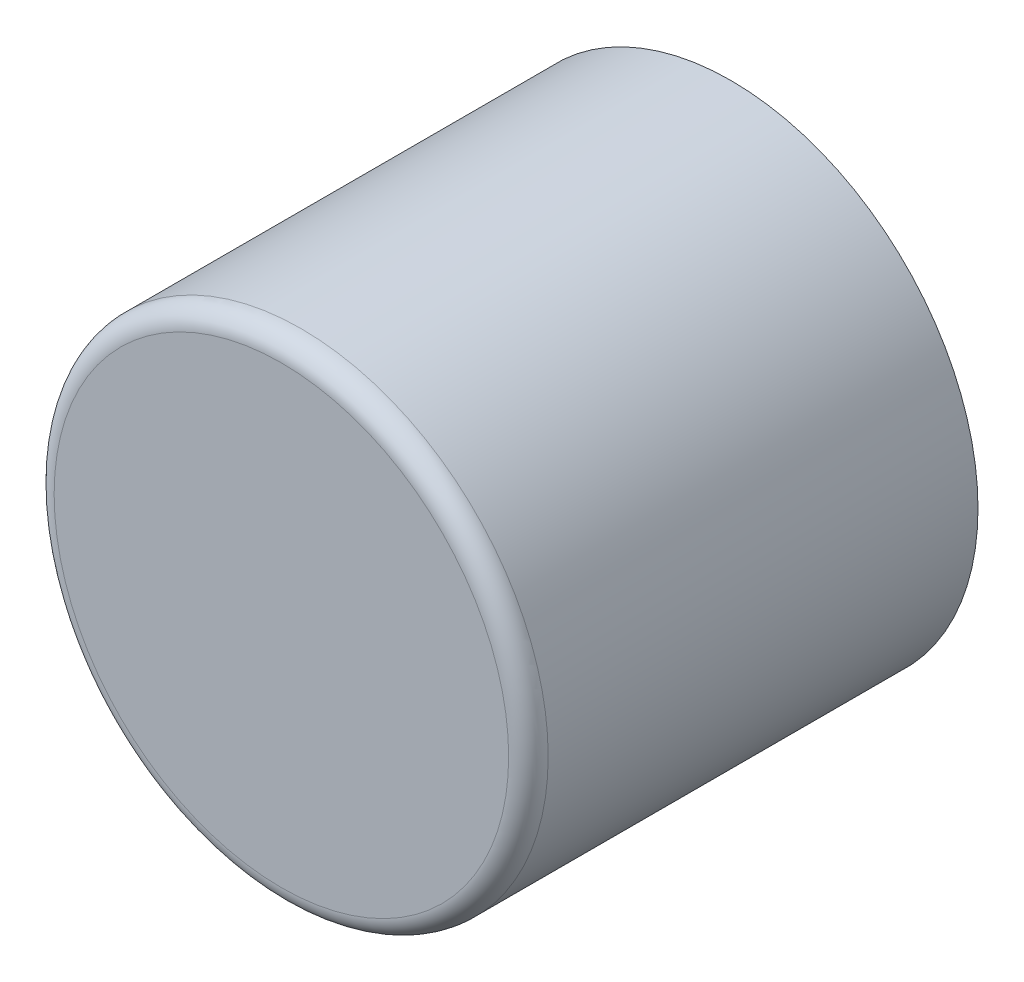
ISO-10303-21;
HEADER;
FILE_DESCRIPTION(('STEP AP214'),'2;1');
FILE_NAME('part.step','',(''),(''),'','','');
FILE_SCHEMA(('AUTOMOTIVE_DESIGN { 1 0 10303 214 1 1 1 1 }'));
ENDSEC;
DATA;
#1=APPLICATION_CONTEXT('core data for automotive mechanical design processes');
#2=APPLICATION_PROTOCOL_DEFINITION('international standard','automotive_design',2000,#1);
#3=PRODUCT_CONTEXT('',#1,'mechanical');
#4=PRODUCT('Part','Part','',(#3));
#5=PRODUCT_RELATED_PRODUCT_CATEGORY('part','',(#4));
#6=PRODUCT_DEFINITION_FORMATION('','',#4);
#7=PRODUCT_DEFINITION_CONTEXT('part definition',#1,'design');
#8=PRODUCT_DEFINITION('design','',#6,#7);
#9=PRODUCT_DEFINITION_SHAPE('','',#8);
#10=(LENGTH_UNIT() NAMED_UNIT(*) SI_UNIT(.MILLI.,.METRE.));
#11=(NAMED_UNIT(*) PLANE_ANGLE_UNIT() SI_UNIT($,.RADIAN.));
#12=(NAMED_UNIT(*) SI_UNIT($,.STERADIAN.) SOLID_ANGLE_UNIT());
#13=UNCERTAINTY_MEASURE_WITH_UNIT(LENGTH_MEASURE(1.E-05),#10,'distance_accuracy_value','');
#14=(GEOMETRIC_REPRESENTATION_CONTEXT(3) GLOBAL_UNCERTAINTY_ASSIGNED_CONTEXT((#13)) GLOBAL_UNIT_ASSIGNED_CONTEXT((#10,
#11,#12)) REPRESENTATION_CONTEXT('',''));
#15=CARTESIAN_POINT('',(0.,0.,0.));
#16=DIRECTION('',(0.,0.,1.));
#17=DIRECTION('',(1.,0.,0.));
#18=AXIS2_PLACEMENT_3D('',#15,#16,#17);
#19=CARTESIAN_POINT('',(2.65,2.65,6.));
#20=DIRECTION('',(0.,0.,-1.));
#21=DIRECTION('',(-1.,0.,0.));
#22=AXIS2_PLACEMENT_3D('',#19,#20,#21);
#23=PLANE('',#22);
#24=CARTESIAN_POINT('',(2.65,2.65,6.));
#25=DIRECTION('',(0.,0.,-1.));
#26=DIRECTION('',(1.,0.,0.));
#27=AXIS2_PLACEMENT_3D('',#24,#25,#26);
#28=CIRCLE('',#27,2.3);
#29=CARTESIAN_POINT('',(4.95,2.65,6.));
#30=VERTEX_POINT('',#29);
#31=EDGE_CURVE('E25',#30,#30,#28,.T.);
#32=ORIENTED_EDGE('',*,*,#31,.F.);
#33=EDGE_LOOP('',(#32));
#34=FACE_BOUND('',#33,.T.);
#35=ADVANCED_FACE('F14',(#34),#23,.F.);
#36=CARTESIAN_POINT('',(2.65,2.65,5.8));
#37=DIRECTION('',(0.,0.,-1.));
#38=DIRECTION('',(-1.,0.,0.));
#39=AXIS2_PLACEMENT_3D('',#36,#37,#38);
#40=TOROIDAL_SURFACE('',#39,2.3,0.2);
#41=CARTESIAN_POINT('',(2.65,2.65,5.8));
#42=DIRECTION('',(0.,0.,-1.));
#43=DIRECTION('',(-1.,0.,0.));
#44=AXIS2_PLACEMENT_3D('',#41,#42,#43);
#45=CIRCLE('',#44,2.5);
#46=CARTESIAN_POINT('',(0.150000000000001,2.65,5.8));
#47=VERTEX_POINT('',#46);
#48=EDGE_CURVE('E21',#47,#47,#45,.T.);
#49=ORIENTED_EDGE('',*,*,#48,.F.);
#50=EDGE_LOOP('',(#49));
#51=FACE_BOUND('',#50,.T.);
#52=ORIENTED_EDGE('',*,*,#31,.T.);
#53=EDGE_LOOP('',(#52));
#54=FACE_BOUND('',#53,.T.);
#55=ADVANCED_FACE('F35',(#51,#54),#40,.T.);
#56=CARTESIAN_POINT('',(2.65,2.65,1.45));
#57=DIRECTION('',(0.,0.,-1.));
#58=DIRECTION('',(-1.,0.,0.));
#59=AXIS2_PLACEMENT_3D('',#56,#57,#58);
#60=PLANE('',#59);
#61=CARTESIAN_POINT('',(2.65,2.65,1.45));
#62=DIRECTION('',(0.,0.,-1.));
#63=DIRECTION('',(-1.,0.,0.));
#64=AXIS2_PLACEMENT_3D('',#61,#62,#63);
#65=CIRCLE('',#64,2.5);
#66=CARTESIAN_POINT('',(0.150000000000001,2.65,1.45));
#67=VERTEX_POINT('',#66);
#68=EDGE_CURVE('E9',#67,#67,#65,.F.);
#69=ORIENTED_EDGE('',*,*,#68,.F.);
#70=EDGE_LOOP('',(#69));
#71=FACE_BOUND('',#70,.T.);
#72=ADVANCED_FACE('F39',(#71),#60,.T.);
#73=CARTESIAN_POINT('',(2.65,2.65,1.45));
#74=DIRECTION('',(0.,0.,-1.));
#75=DIRECTION('',(-1.,0.,0.));
#76=AXIS2_PLACEMENT_3D('',#73,#74,#75);
#77=CYLINDRICAL_SURFACE('',#76,2.5);
#78=ORIENTED_EDGE('',*,*,#48,.T.);
#79=EDGE_LOOP('',(#78));
#80=FACE_BOUND('',#79,.T.);
#81=ORIENTED_EDGE('',*,*,#68,.T.);
#82=EDGE_LOOP('',(#81));
#83=FACE_BOUND('',#82,.T.);
#84=ADVANCED_FACE('F63',(#80,#83),#77,.T.);
#85=CLOSED_SHELL('',(#35,#55,#72,#84));
#86=MANIFOLD_SOLID_BREP('B1',#85);
#87=ADVANCED_BREP_SHAPE_REPRESENTATION('',(#18,#86),#14);
#88=SHAPE_DEFINITION_REPRESENTATION(#9,#87);
ENDSEC;
END-ISO-10303-21;
